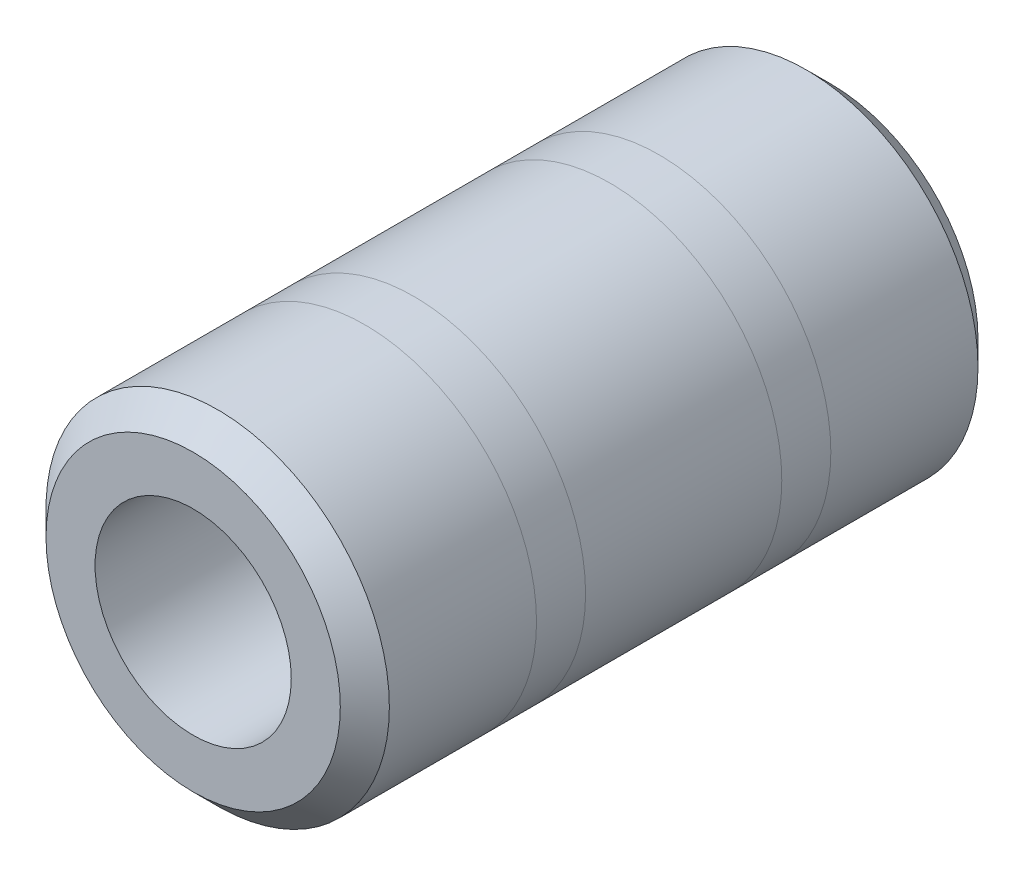
ISO-10303-21;
HEADER;
FILE_DESCRIPTION(('STEP AP214'),'2;1');
FILE_NAME('part.step','',(''),(''),'','','');
FILE_SCHEMA(('AUTOMOTIVE_DESIGN { 1 0 10303 214 1 1 1 1 }'));
ENDSEC;
DATA;
#1=APPLICATION_CONTEXT('core data for automotive mechanical design processes');
#2=APPLICATION_PROTOCOL_DEFINITION('international standard','automotive_design',2000,#1);
#3=PRODUCT_CONTEXT('',#1,'mechanical');
#4=PRODUCT('Part','Part','',(#3));
#5=PRODUCT_RELATED_PRODUCT_CATEGORY('part','',(#4));
#6=PRODUCT_DEFINITION_FORMATION('','',#4);
#7=PRODUCT_DEFINITION_CONTEXT('part definition',#1,'design');
#8=PRODUCT_DEFINITION('design','',#6,#7);
#9=PRODUCT_DEFINITION_SHAPE('','',#8);
#10=(LENGTH_UNIT() NAMED_UNIT(*) SI_UNIT(.MILLI.,.METRE.));
#11=(NAMED_UNIT(*) PLANE_ANGLE_UNIT() SI_UNIT($,.RADIAN.));
#12=(NAMED_UNIT(*) SI_UNIT($,.STERADIAN.) SOLID_ANGLE_UNIT());
#13=UNCERTAINTY_MEASURE_WITH_UNIT(LENGTH_MEASURE(1.E-05),#10,'distance_accuracy_value','');
#14=(GEOMETRIC_REPRESENTATION_CONTEXT(3) GLOBAL_UNCERTAINTY_ASSIGNED_CONTEXT((#13)) GLOBAL_UNIT_ASSIGNED_CONTEXT((#10,
#11,#12)) REPRESENTATION_CONTEXT('',''));
#15=CARTESIAN_POINT('',(0.,0.,0.));
#16=DIRECTION('',(0.,0.,1.));
#17=DIRECTION('',(1.,0.,0.));
#18=AXIS2_PLACEMENT_3D('',#15,#16,#17);
#19=CARTESIAN_POINT('',(0.,0.,65.));
#20=DIRECTION('',(0.,0.,-1.));
#21=DIRECTION('',(-1.,0.,0.));
#22=AXIS2_PLACEMENT_3D('',#19,#20,#21);
#23=CYLINDRICAL_SURFACE('',#22,17.5);
#24=CARTESIAN_POINT('',(0.,0.,62.5));
#25=DIRECTION('',(0.,0.,1.));
#26=DIRECTION('',(1.,0.,0.));
#27=AXIS2_PLACEMENT_3D('',#24,#25,#26);
#28=CIRCLE('',#27,17.5);
#29=CARTESIAN_POINT('',(17.5,0.,62.5));
#30=VERTEX_POINT('',#29);
#31=EDGE_CURVE('E75',#30,#30,#28,.F.);
#32=ORIENTED_EDGE('',*,*,#31,.T.);
#33=EDGE_LOOP('',(#32));
#34=FACE_BOUND('',#33,.T.);
#35=CARTESIAN_POINT('',(0.,0.,47.5));
#36=DIRECTION('',(0.,0.,1.));
#37=DIRECTION('',(1.,0.,0.));
#38=AXIS2_PLACEMENT_3D('',#35,#36,#37);
#39=CIRCLE('',#38,17.5);
#40=CARTESIAN_POINT('',(17.5,0.,47.5));
#41=VERTEX_POINT('',#40);
#42=EDGE_CURVE('E11',#41,#41,#39,.T.);
#43=ORIENTED_EDGE('',*,*,#42,.T.);
#44=EDGE_LOOP('',(#43));
#45=FACE_BOUND('',#44,.T.);
#46=ADVANCED_FACE('F51',(#34,#45),#23,.T.);
#47=ORIENTED_EDGE('',*,*,#42,.F.);
#48=EDGE_LOOP('',(#47));
#49=FACE_BOUND('',#48,.T.);
#50=CARTESIAN_POINT('',(0.,0.,42.5));
#51=DIRECTION('',(0.,0.,1.));
#52=DIRECTION('',(1.,0.,0.));
#53=AXIS2_PLACEMENT_3D('',#50,#51,#52);
#54=CIRCLE('',#53,17.5);
#55=CARTESIAN_POINT('',(17.5,0.,42.5));
#56=VERTEX_POINT('',#55);
#57=EDGE_CURVE('E59',#56,#56,#54,.T.);
#58=ORIENTED_EDGE('',*,*,#57,.T.);
#59=EDGE_LOOP('',(#58));
#60=FACE_BOUND('',#59,.T.);
#61=ADVANCED_FACE('F109',(#49,#60),#23,.T.);
#62=ORIENTED_EDGE('',*,*,#57,.F.);
#63=EDGE_LOOP('',(#62));
#64=FACE_BOUND('',#63,.T.);
#65=CARTESIAN_POINT('',(0.,0.,22.5));
#66=DIRECTION('',(0.,0.,1.));
#67=DIRECTION('',(1.,0.,0.));
#68=AXIS2_PLACEMENT_3D('',#65,#66,#67);
#69=CIRCLE('',#68,17.5);
#70=CARTESIAN_POINT('',(17.5,0.,22.5));
#71=VERTEX_POINT('',#70);
#72=EDGE_CURVE('E63',#71,#71,#69,.T.);
#73=ORIENTED_EDGE('',*,*,#72,.T.);
#74=EDGE_LOOP('',(#73));
#75=FACE_BOUND('',#74,.T.);
#76=ADVANCED_FACE('F116',(#64,#75),#23,.T.);
#77=ORIENTED_EDGE('',*,*,#72,.F.);
#78=EDGE_LOOP('',(#77));
#79=FACE_BOUND('',#78,.T.);
#80=CARTESIAN_POINT('',(0.,0.,17.5));
#81=DIRECTION('',(0.,0.,1.));
#82=DIRECTION('',(1.,0.,0.));
#83=AXIS2_PLACEMENT_3D('',#80,#81,#82);
#84=CIRCLE('',#83,17.5);
#85=CARTESIAN_POINT('',(17.5,0.,17.5));
#86=VERTEX_POINT('',#85);
#87=EDGE_CURVE('E67',#86,#86,#84,.T.);
#88=ORIENTED_EDGE('',*,*,#87,.T.);
#89=EDGE_LOOP('',(#88));
#90=FACE_BOUND('',#89,.T.);
#91=ADVANCED_FACE('F118',(#79,#90),#23,.T.);
#92=ORIENTED_EDGE('',*,*,#87,.F.);
#93=EDGE_LOOP('',(#92));
#94=FACE_BOUND('',#93,.T.);
#95=CARTESIAN_POINT('',(0.,0.,2.50000000000001));
#96=DIRECTION('',(0.,0.,1.));
#97=DIRECTION('',(1.,0.,0.));
#98=AXIS2_PLACEMENT_3D('',#95,#96,#97);
#99=CIRCLE('',#98,17.5);
#100=CARTESIAN_POINT('',(17.5,0.,2.50000000000001));
#101=VERTEX_POINT('',#100);
#102=EDGE_CURVE('E78',#101,#101,#99,.T.);
#103=ORIENTED_EDGE('',*,*,#102,.T.);
#104=EDGE_LOOP('',(#103));
#105=FACE_BOUND('',#104,.T.);
#106=ADVANCED_FACE('F112',(#94,#105),#23,.T.);
#107=CARTESIAN_POINT('',(0.,0.,65.));
#108=DIRECTION('',(0.,0.,1.));
#109=DIRECTION('',(1.,0.,0.));
#110=AXIS2_PLACEMENT_3D('',#107,#108,#109);
#111=PLANE('',#110);
#112=CARTESIAN_POINT('',(0.,0.,65.));
#113=DIRECTION('',(0.,0.,1.));
#114=DIRECTION('',(1.,0.,0.));
#115=AXIS2_PLACEMENT_3D('',#112,#113,#114);
#116=CIRCLE('',#115,15.);
#117=CARTESIAN_POINT('',(15.,0.,65.));
#118=VERTEX_POINT('',#117);
#119=EDGE_CURVE('E81',#118,#118,#116,.T.);
#120=ORIENTED_EDGE('',*,*,#119,.T.);
#121=EDGE_LOOP('',(#120));
#122=FACE_BOUND('',#121,.T.);
#123=CARTESIAN_POINT('',(0.,0.,65.));
#124=DIRECTION('',(0.,0.,1.));
#125=DIRECTION('',(1.,0.,0.));
#126=AXIS2_PLACEMENT_3D('',#123,#124,#125);
#127=CIRCLE('',#126,10.);
#128=CARTESIAN_POINT('',(10.,0.,65.));
#129=VERTEX_POINT('',#128);
#130=EDGE_CURVE('E84',#129,#129,#127,.T.);
#131=ORIENTED_EDGE('',*,*,#130,.F.);
#132=EDGE_LOOP('',(#131));
#133=FACE_BOUND('',#132,.T.);
#134=ADVANCED_FACE('F104',(#122,#133),#111,.T.);
#135=CARTESIAN_POINT('',(0.,0.,0.));
#136=DIRECTION('',(0.,0.,1.));
#137=DIRECTION('',(1.,0.,0.));
#138=AXIS2_PLACEMENT_3D('',#135,#136,#137);
#139=PLANE('',#138);
#140=CARTESIAN_POINT('',(0.,0.,0.));
#141=DIRECTION('',(0.,0.,1.));
#142=DIRECTION('',(1.,0.,0.));
#143=AXIS2_PLACEMENT_3D('',#140,#141,#142);
#144=CIRCLE('',#143,15.);
#145=CARTESIAN_POINT('',(15.,0.,0.));
#146=VERTEX_POINT('',#145);
#147=EDGE_CURVE('E72',#146,#146,#144,.F.);
#148=ORIENTED_EDGE('',*,*,#147,.T.);
#149=EDGE_LOOP('',(#148));
#150=FACE_BOUND('',#149,.T.);
#151=CARTESIAN_POINT('',(0.,0.,0.));
#152=DIRECTION('',(0.,0.,1.));
#153=DIRECTION('',(1.,0.,0.));
#154=AXIS2_PLACEMENT_3D('',#151,#152,#153);
#155=CIRCLE('',#154,10.);
#156=CARTESIAN_POINT('',(10.,0.,0.));
#157=VERTEX_POINT('',#156);
#158=EDGE_CURVE('E87',#157,#157,#155,.T.);
#159=ORIENTED_EDGE('',*,*,#158,.T.);
#160=EDGE_LOOP('',(#159));
#161=FACE_BOUND('',#160,.T.);
#162=ADVANCED_FACE('F91',(#150,#161),#139,.F.);
#163=CARTESIAN_POINT('',(0.,0.,0.));
#164=DIRECTION('',(0.,0.,1.));
#165=DIRECTION('',(1.,0.,0.));
#166=AXIS2_PLACEMENT_3D('',#163,#164,#165);
#167=CYLINDRICAL_SURFACE('',#166,10.);
#168=ORIENTED_EDGE('',*,*,#130,.T.);
#169=EDGE_LOOP('',(#168));
#170=FACE_BOUND('',#169,.T.);
#171=ORIENTED_EDGE('',*,*,#158,.F.);
#172=EDGE_LOOP('',(#171));
#173=FACE_BOUND('',#172,.T.);
#174=ADVANCED_FACE('F93',(#170,#173),#167,.F.);
#175=CARTESIAN_POINT('',(0.,0.,65.));
#176=DIRECTION('',(0.,0.,-1.));
#177=DIRECTION('',(-1.,0.,0.));
#178=AXIS2_PLACEMENT_3D('',#175,#176,#177);
#179=CONICAL_SURFACE('',#178,15.,0.785398163397446);
#180=ORIENTED_EDGE('',*,*,#31,.F.);
#181=EDGE_LOOP('',(#180));
#182=FACE_BOUND('',#181,.T.);
#183=ORIENTED_EDGE('',*,*,#119,.F.);
#184=EDGE_LOOP('',(#183));
#185=FACE_BOUND('',#184,.T.);
#186=ADVANCED_FACE('F95',(#182,#185),#179,.T.);
#187=CARTESIAN_POINT('',(0.,0.,2.50000000000001));
#188=DIRECTION('',(0.,0.,1.));
#189=DIRECTION('',(1.,0.,0.));
#190=AXIS2_PLACEMENT_3D('',#187,#188,#189);
#191=CONICAL_SURFACE('',#190,17.5,0.785398163397449);
#192=ORIENTED_EDGE('',*,*,#147,.F.);
#193=EDGE_LOOP('',(#192));
#194=FACE_BOUND('',#193,.T.);
#195=ORIENTED_EDGE('',*,*,#102,.F.);
#196=EDGE_LOOP('',(#195));
#197=FACE_BOUND('',#196,.T.);
#198=ADVANCED_FACE('F54',(#194,#197),#191,.T.);
#199=CLOSED_SHELL('',(#46,#61,#76,#91,#106,#134,#162,#174,#186,#198));
#200=MANIFOLD_SOLID_BREP('B2',#199);
#201=ADVANCED_BREP_SHAPE_REPRESENTATION('',(#18,#200),#14);
#202=SHAPE_DEFINITION_REPRESENTATION(#9,#201);
ENDSEC;
END-ISO-10303-21;
